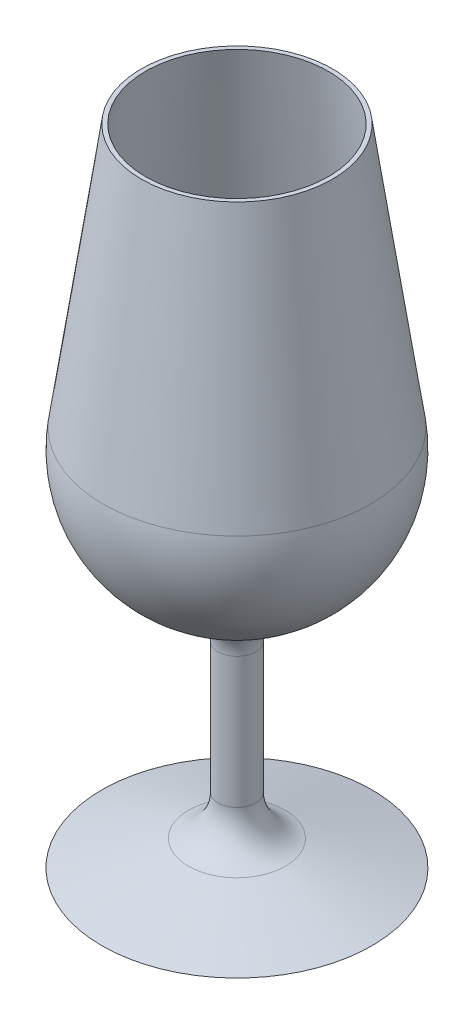
ISO-10303-21;
HEADER;
FILE_DESCRIPTION(('STEP AP214'),'2;1');
FILE_NAME('part.step','',(''),(''),'','','');
FILE_SCHEMA(('AUTOMOTIVE_DESIGN { 1 0 10303 214 1 1 1 1 }'));
ENDSEC;
DATA;
#1=APPLICATION_CONTEXT('core data for automotive mechanical design processes');
#2=APPLICATION_PROTOCOL_DEFINITION('international standard','automotive_design',2000,#1);
#3=PRODUCT_CONTEXT('',#1,'mechanical');
#4=PRODUCT('Part','Part','',(#3));
#5=PRODUCT_RELATED_PRODUCT_CATEGORY('part','',(#4));
#6=PRODUCT_DEFINITION_FORMATION('','',#4);
#7=PRODUCT_DEFINITION_CONTEXT('part definition',#1,'design');
#8=PRODUCT_DEFINITION('design','',#6,#7);
#9=PRODUCT_DEFINITION_SHAPE('','',#8);
#10=(LENGTH_UNIT() NAMED_UNIT(*) SI_UNIT(.MILLI.,.METRE.));
#11=(NAMED_UNIT(*) PLANE_ANGLE_UNIT() SI_UNIT($,.RADIAN.));
#12=(NAMED_UNIT(*) SI_UNIT($,.STERADIAN.) SOLID_ANGLE_UNIT());
#13=UNCERTAINTY_MEASURE_WITH_UNIT(LENGTH_MEASURE(1.E-05),#10,'distance_accuracy_value','');
#14=(GEOMETRIC_REPRESENTATION_CONTEXT(3) GLOBAL_UNCERTAINTY_ASSIGNED_CONTEXT((#13)) GLOBAL_UNIT_ASSIGNED_CONTEXT((#10,
#11,#12)) REPRESENTATION_CONTEXT('',''));
#15=CARTESIAN_POINT('',(0.,0.,0.));
#16=DIRECTION('',(0.,0.,1.));
#17=DIRECTION('',(1.,0.,0.));
#18=AXIS2_PLACEMENT_3D('',#15,#16,#17);
#19=CARTESIAN_POINT('',(0.,-37.0912982763871,0.));
#20=DIRECTION('',(0.,1.,0.));
#21=DIRECTION('',(0.,0.,1.));
#22=AXIS2_PLACEMENT_3D('',#19,#20,#21);
#23=PLANE('',#22);
#24=CARTESIAN_POINT('',(0.,-37.0912982763871,0.));
#25=DIRECTION('',(0.,1.,0.));
#26=DIRECTION('',(0.,0.,1.));
#27=AXIS2_PLACEMENT_3D('',#24,#25,#26);
#28=CIRCLE('',#27,32.5);
#29=CARTESIAN_POINT('',(0.,-37.0912982763871,32.5));
#30=VERTEX_POINT('',#29);
#31=EDGE_CURVE('E10',#30,#30,#28,.T.);
#32=ORIENTED_EDGE('',*,*,#31,.F.);
#33=EDGE_LOOP('',(#32));
#34=FACE_BOUND('',#33,.T.);
#35=ADVANCED_FACE('F34',(#34),#23,.F.);
#36=CARTESIAN_POINT('',(0.,-37.0912982763871,0.));
#37=DIRECTION('',(0.,-1.,0.));
#38=DIRECTION('',(0.,0.,-1.));
#39=AXIS2_PLACEMENT_3D('',#36,#37,#38);
#40=CONICAL_SURFACE('',#39,32.5,1.28350582245761);
#41=CARTESIAN_POINT('',(0.,-30.9357267356772,0.));
#42=DIRECTION('',(0.,1.,0.));
#43=DIRECTION('',(0.,0.,1.));
#44=AXIS2_PLACEMENT_3D('',#41,#42,#43);
#45=CIRCLE('',#44,11.6664517898233);
#46=CARTESIAN_POINT('',(0.,-30.9357267356772,11.6664517898233));
#47=VERTEX_POINT('',#46);
#48=EDGE_CURVE('E40',#47,#47,#45,.T.);
#49=ORIENTED_EDGE('',*,*,#48,.F.);
#50=EDGE_LOOP('',(#49));
#51=FACE_BOUND('',#50,.T.);
#52=ORIENTED_EDGE('',*,*,#31,.T.);
#53=EDGE_LOOP('',(#52));
#54=FACE_BOUND('',#53,.T.);
#55=ADVANCED_FACE('F109',(#51,#54),#40,.T.);
#56=CARTESIAN_POINT('',(0.,-21.3455753009706,0.));
#57=DIRECTION('',(0.,1.,0.));
#58=DIRECTION('',(0.,0.,1.));
#59=AXIS2_PLACEMENT_3D('',#56,#57,#58);
#60=TOROIDAL_SURFACE('',#59,14.5,10.);
#61=CARTESIAN_POINT('',(0.,-21.3455753009706,0.));
#62=DIRECTION('',(0.,1.,0.));
#63=DIRECTION('',(0.,0.,1.));
#64=AXIS2_PLACEMENT_3D('',#61,#62,#63);
#65=CIRCLE('',#64,4.50000000000001);
#66=CARTESIAN_POINT('',(0.,-21.3455753009706,4.50000000000001));
#67=VERTEX_POINT('',#66);
#68=EDGE_CURVE('E44',#67,#67,#65,.T.);
#69=ORIENTED_EDGE('',*,*,#68,.F.);
#70=EDGE_LOOP('',(#69));
#71=FACE_BOUND('',#70,.T.);
#72=ORIENTED_EDGE('',*,*,#48,.T.);
#73=EDGE_LOOP('',(#72));
#74=FACE_BOUND('',#73,.T.);
#75=ADVANCED_FACE('F104',(#71,#74),#60,.F.);
#76=CARTESIAN_POINT('',(0.,117.908701723613,0.));
#77=DIRECTION('',(0.,1.,0.));
#78=DIRECTION('',(0.,0.,1.));
#79=AXIS2_PLACEMENT_3D('',#76,#77,#78);
#80=CYLINDRICAL_SURFACE('',#79,4.50000000000001);
#81=CARTESIAN_POINT('',(0.,10.1456868915987,0.));
#82=DIRECTION('',(0.,1.,0.));
#83=DIRECTION('',(0.,0.,1.));
#84=AXIS2_PLACEMENT_3D('',#81,#82,#83);
#85=CIRCLE('',#84,4.50000000000001);
#86=CARTESIAN_POINT('',(0.,10.1456868915987,4.50000000000001));
#87=VERTEX_POINT('',#86);
#88=EDGE_CURVE('E48',#87,#87,#85,.T.);
#89=ORIENTED_EDGE('',*,*,#88,.F.);
#90=EDGE_LOOP('',(#89));
#91=FACE_BOUND('',#90,.T.);
#92=ORIENTED_EDGE('',*,*,#68,.T.);
#93=EDGE_LOOP('',(#92));
#94=FACE_BOUND('',#93,.T.);
#95=ADVANCED_FACE('F98',(#91,#94),#80,.T.);
#96=CARTESIAN_POINT('',(0.,10.1456868915987,0.));
#97=DIRECTION('',(0.,1.,0.));
#98=DIRECTION('',(0.,0.,1.));
#99=AXIS2_PLACEMENT_3D('',#96,#97,#98);
#100=TOROIDAL_SURFACE('',#99,14.5,10.);
#101=CARTESIAN_POINT('',(0.,19.545679529452,0.));
#102=DIRECTION('',(0.,1.,0.));
#103=DIRECTION('',(0.,0.,1.));
#104=AXIS2_PLACEMENT_3D('',#101,#102,#103);
#105=CIRCLE('',#104,11.0882352941177);
#106=CARTESIAN_POINT('',(0.,19.545679529452,11.0882352941177));
#107=VERTEX_POINT('',#106);
#108=EDGE_CURVE('E53',#107,#107,#105,.T.);
#109=ORIENTED_EDGE('',*,*,#108,.F.);
#110=EDGE_LOOP('',(#109));
#111=FACE_BOUND('',#110,.T.);
#112=ORIENTED_EDGE('',*,*,#88,.T.);
#113=EDGE_LOOP('',(#112));
#114=FACE_BOUND('',#113,.T.);
#115=ADVANCED_FACE('F92',(#111,#114),#100,.F.);
#116=CARTESIAN_POINT('',(0.,50.095655602475,0.));
#117=DIRECTION('',(0.,1.,0.));
#118=DIRECTION('',(1.,0.,0.));
#119=AXIS2_PLACEMENT_3D('',#116,#117,#118);
#120=SPHERICAL_SURFACE('',#119,32.5);
#121=CARTESIAN_POINT('',(0.,54.7628687751407,0.));
#122=DIRECTION('',(0.,1.,0.));
#123=DIRECTION('',(0.,0.,1.));
#124=AXIS2_PLACEMENT_3D('',#121,#122,#123);
#125=CIRCLE('',#124,32.1631329506455);
#126=CARTESIAN_POINT('',(0.,54.7628687751407,32.1631329506455));
#127=VERTEX_POINT('',#126);
#128=EDGE_CURVE('E56',#127,#127,#125,.T.);
#129=ORIENTED_EDGE('',*,*,#128,.F.);
#130=EDGE_LOOP('',(#129));
#131=FACE_BOUND('',#130,.T.);
#132=ORIENTED_EDGE('',*,*,#108,.T.);
#133=EDGE_LOOP('',(#132));
#134=FACE_BOUND('',#133,.T.);
#135=ADVANCED_FACE('F86',(#131,#134),#120,.T.);
#136=CARTESIAN_POINT('',(0.,54.7628687751407,0.));
#137=DIRECTION('',(0.,-1.,0.));
#138=DIRECTION('',(0.,0.,-1.));
#139=AXIS2_PLACEMENT_3D('',#136,#137,#138);
#140=CONICAL_SURFACE('',#139,32.1631329506455,0.144104792839711);
#141=CARTESIAN_POINT('',(0.,117.908701723613,0.));
#142=DIRECTION('',(0.,1.,0.));
#143=DIRECTION('',(0.,0.,1.));
#144=AXIS2_PLACEMENT_3D('',#141,#142,#143);
#145=CIRCLE('',#144,23.);
#146=CARTESIAN_POINT('',(0.,117.908701723613,23.));
#147=VERTEX_POINT('',#146);
#148=EDGE_CURVE('E59',#147,#147,#145,.T.);
#149=ORIENTED_EDGE('',*,*,#148,.F.);
#150=EDGE_LOOP('',(#149));
#151=FACE_BOUND('',#150,.T.);
#152=ORIENTED_EDGE('',*,*,#128,.T.);
#153=EDGE_LOOP('',(#152));
#154=FACE_BOUND('',#153,.T.);
#155=ADVANCED_FACE('F80',(#151,#154),#140,.T.);
#156=CARTESIAN_POINT('',(21.9895262986391,117.908701723613,0.));
#157=DIRECTION('',(0.,-1.,0.));
#158=DIRECTION('',(0.,0.,-1.));
#159=AXIS2_PLACEMENT_3D('',#156,#157,#158);
#160=PLANE('',#159);
#161=CARTESIAN_POINT('',(0.,117.908701723613,0.));
#162=DIRECTION('',(0.,1.,0.));
#163=DIRECTION('',(0.,0.,1.));
#164=AXIS2_PLACEMENT_3D('',#161,#162,#163);
#165=CIRCLE('',#164,21.9895262986391);
#166=CARTESIAN_POINT('',(0.,117.908701723613,21.9895262986391));
#167=VERTEX_POINT('',#166);
#168=EDGE_CURVE('E62',#167,#167,#165,.T.);
#169=ORIENTED_EDGE('',*,*,#168,.F.);
#170=EDGE_LOOP('',(#169));
#171=FACE_BOUND('',#170,.T.);
#172=ORIENTED_EDGE('',*,*,#148,.T.);
#173=EDGE_LOOP('',(#172));
#174=FACE_BOUND('',#173,.T.);
#175=ADVANCED_FACE('F74',(#171,#174),#160,.F.);
#176=CARTESIAN_POINT('',(0.,117.908701723613,0.));
#177=DIRECTION('',(0.,-1.,0.));
#178=DIRECTION('',(0.,0.,-1.));
#179=AXIS2_PLACEMENT_3D('',#176,#177,#178);
#180=CONICAL_SURFACE('',#179,21.9895262986391,0.144104792839711);
#181=CARTESIAN_POINT('',(0.,54.6192622159817,0.));
#182=DIRECTION('',(0.,1.,0.));
#183=DIRECTION('',(0.,0.,1.));
#184=AXIS2_PLACEMENT_3D('',#181,#182,#183);
#185=CIRCLE('',#184,31.1734980906256);
#186=CARTESIAN_POINT('',(0.,54.6192622159817,31.1734980906256));
#187=VERTEX_POINT('',#186);
#188=EDGE_CURVE('E65',#187,#187,#185,.T.);
#189=ORIENTED_EDGE('',*,*,#188,.F.);
#190=EDGE_LOOP('',(#189));
#191=FACE_BOUND('',#190,.T.);
#192=ORIENTED_EDGE('',*,*,#168,.T.);
#193=EDGE_LOOP('',(#192));
#194=FACE_BOUND('',#193,.T.);
#195=ADVANCED_FACE('F71',(#191,#194),#180,.F.);
#196=CARTESIAN_POINT('',(0.,50.095655602475,0.));
#197=DIRECTION('',(0.,1.,0.));
#198=DIRECTION('',(1.,0.,0.));
#199=AXIS2_PLACEMENT_3D('',#196,#197,#198);
#200=SPHERICAL_SURFACE('',#199,31.5);
#201=ORIENTED_EDGE('',*,*,#188,.T.);
#202=EDGE_LOOP('',(#201));
#203=FACE_BOUND('',#202,.T.);
#204=ADVANCED_FACE('F69',(#203),#200,.F.);
#205=CLOSED_SHELL('',(#35,#55,#75,#95,#115,#135,#155,#175,#195,#204));
#206=MANIFOLD_SOLID_BREP('B2',#205);
#207=ADVANCED_BREP_SHAPE_REPRESENTATION('',(#18,#206),#14);
#208=SHAPE_DEFINITION_REPRESENTATION(#9,#207);
ENDSEC;
END-ISO-10303-21;
